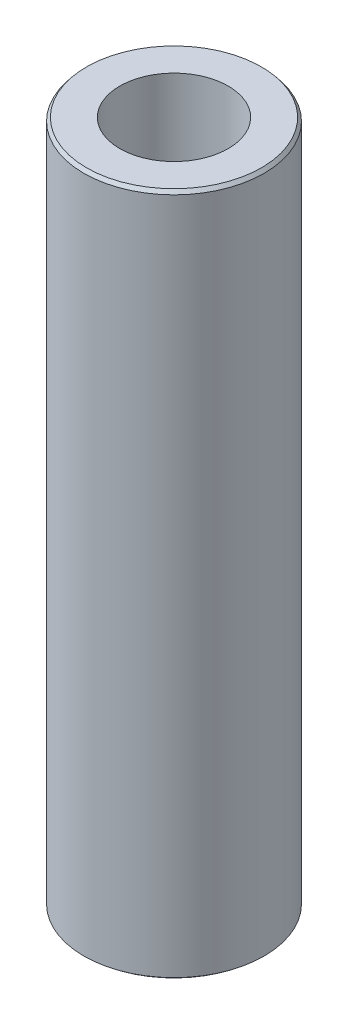
ISO-10303-21;
HEADER;
FILE_DESCRIPTION(('STEP AP214'),'2;1');
FILE_NAME('part.step','',(''),(''),'','','');
FILE_SCHEMA(('AUTOMOTIVE_DESIGN { 1 0 10303 214 1 1 1 1 }'));
ENDSEC;
DATA;
#1=APPLICATION_CONTEXT('core data for automotive mechanical design processes');
#2=APPLICATION_PROTOCOL_DEFINITION('international standard','automotive_design',2000,#1);
#3=PRODUCT_CONTEXT('',#1,'mechanical');
#4=PRODUCT('Part','Part','',(#3));
#5=PRODUCT_RELATED_PRODUCT_CATEGORY('part','',(#4));
#6=PRODUCT_DEFINITION_FORMATION('','',#4);
#7=PRODUCT_DEFINITION_CONTEXT('part definition',#1,'design');
#8=PRODUCT_DEFINITION('design','',#6,#7);
#9=PRODUCT_DEFINITION_SHAPE('','',#8);
#10=(LENGTH_UNIT() NAMED_UNIT(*) SI_UNIT(.MILLI.,.METRE.));
#11=(NAMED_UNIT(*) PLANE_ANGLE_UNIT() SI_UNIT($,.RADIAN.));
#12=(NAMED_UNIT(*) SI_UNIT($,.STERADIAN.) SOLID_ANGLE_UNIT());
#13=UNCERTAINTY_MEASURE_WITH_UNIT(LENGTH_MEASURE(1.E-05),#10,'distance_accuracy_value','');
#14=(GEOMETRIC_REPRESENTATION_CONTEXT(3) GLOBAL_UNCERTAINTY_ASSIGNED_CONTEXT((#13)) GLOBAL_UNIT_ASSIGNED_CONTEXT((#10,
#11,#12)) REPRESENTATION_CONTEXT('',''));
#15=CARTESIAN_POINT('',(0.,0.,0.));
#16=DIRECTION('',(0.,0.,1.));
#17=DIRECTION('',(1.,0.,0.));
#18=AXIS2_PLACEMENT_3D('',#15,#16,#17);
#19=CARTESIAN_POINT('',(0.,113.818768585816,0.));
#20=DIRECTION('',(0.,-1.,0.));
#21=DIRECTION('',(0.,0.,-1.));
#22=AXIS2_PLACEMENT_3D('',#19,#20,#21);
#23=CYLINDRICAL_SURFACE('',#22,15.);
#24=CARTESIAN_POINT('',(0.,113.250826087263,0.));
#25=DIRECTION('',(0.,1.,0.));
#26=DIRECTION('',(0.,0.,1.));
#27=AXIS2_PLACEMENT_3D('',#24,#25,#26);
#28=CIRCLE('',#27,15.);
#29=CARTESIAN_POINT('',(0.,113.250826087263,15.));
#30=VERTEX_POINT('',#29);
#31=EDGE_CURVE('E50',#30,#30,#28,.F.);
#32=ORIENTED_EDGE('',*,*,#31,.T.);
#33=EDGE_LOOP('',(#32));
#34=FACE_BOUND('',#33,.T.);
#35=CARTESIAN_POINT('',(0.,0.449791564454419,0.));
#36=DIRECTION('',(0.,1.,0.));
#37=DIRECTION('',(0.,0.,1.));
#38=AXIS2_PLACEMENT_3D('',#35,#36,#37);
#39=CIRCLE('',#38,15.);
#40=CARTESIAN_POINT('',(0.,0.449791564454419,15.));
#41=VERTEX_POINT('',#40);
#42=EDGE_CURVE('E51',#41,#41,#39,.T.);
#43=ORIENTED_EDGE('',*,*,#42,.T.);
#44=EDGE_LOOP('',(#43));
#45=FACE_BOUND('',#44,.T.);
#46=ADVANCED_FACE('F39',(#34,#45),#23,.T.);
#47=CARTESIAN_POINT('',(0.,113.818768585816,0.));
#48=DIRECTION('',(0.,1.,0.));
#49=DIRECTION('',(0.,0.,1.));
#50=AXIS2_PLACEMENT_3D('',#47,#48,#49);
#51=PLANE('',#50);
#52=CARTESIAN_POINT('',(0.,113.818768585816,0.));
#53=DIRECTION('',(0.,1.,0.));
#54=DIRECTION('',(0.,0.,1.));
#55=AXIS2_PLACEMENT_3D('',#52,#53,#54);
#56=CIRCLE('',#55,14.5502084355456);
#57=CARTESIAN_POINT('',(0.,113.818768585816,14.5502084355456));
#58=VERTEX_POINT('',#57);
#59=EDGE_CURVE('E54',#58,#58,#56,.T.);
#60=ORIENTED_EDGE('',*,*,#59,.T.);
#61=EDGE_LOOP('',(#60));
#62=FACE_BOUND('',#61,.T.);
#63=CARTESIAN_POINT('',(0.,113.818768585816,0.));
#64=DIRECTION('',(0.,1.,0.));
#65=DIRECTION('',(0.,0.,1.));
#66=AXIS2_PLACEMENT_3D('',#63,#64,#65);
#67=CIRCLE('',#66,9.02254316330759);
#68=CARTESIAN_POINT('',(0.,113.818768585816,9.02254316330759));
#69=VERTEX_POINT('',#68);
#70=EDGE_CURVE('E58',#69,#69,#67,.T.);
#71=ORIENTED_EDGE('',*,*,#70,.F.);
#72=EDGE_LOOP('',(#71));
#73=FACE_BOUND('',#72,.T.);
#74=ADVANCED_FACE('F69',(#62,#73),#51,.T.);
#75=CARTESIAN_POINT('',(0.,0.,0.));
#76=DIRECTION('',(0.,1.,0.));
#77=DIRECTION('',(0.,0.,1.));
#78=AXIS2_PLACEMENT_3D('',#75,#76,#77);
#79=PLANE('',#78);
#80=CARTESIAN_POINT('',(0.,0.,0.));
#81=DIRECTION('',(0.,1.,0.));
#82=DIRECTION('',(0.,0.,1.));
#83=AXIS2_PLACEMENT_3D('',#80,#81,#82);
#84=CIRCLE('',#83,14.4320575014473);
#85=CARTESIAN_POINT('',(0.,0.,14.4320575014473));
#86=VERTEX_POINT('',#85);
#87=EDGE_CURVE('E10',#86,#86,#84,.F.);
#88=ORIENTED_EDGE('',*,*,#87,.T.);
#89=EDGE_LOOP('',(#88));
#90=FACE_BOUND('',#89,.T.);
#91=CARTESIAN_POINT('',(0.,0.,0.));
#92=DIRECTION('',(0.,1.,0.));
#93=DIRECTION('',(0.,0.,1.));
#94=AXIS2_PLACEMENT_3D('',#91,#92,#93);
#95=CIRCLE('',#94,9.02254316330759);
#96=CARTESIAN_POINT('',(0.,0.,9.02254316330759));
#97=VERTEX_POINT('',#96);
#98=EDGE_CURVE('E63',#97,#97,#95,.T.);
#99=ORIENTED_EDGE('',*,*,#98,.T.);
#100=EDGE_LOOP('',(#99));
#101=FACE_BOUND('',#100,.T.);
#102=ADVANCED_FACE('F75',(#90,#101),#79,.F.);
#103=CARTESIAN_POINT('',(0.,113.818768585816,0.));
#104=DIRECTION('',(0.,-1.,0.));
#105=DIRECTION('',(0.,0.,-1.));
#106=AXIS2_PLACEMENT_3D('',#103,#104,#105);
#107=CYLINDRICAL_SURFACE('',#106,9.02254316330759);
#108=ORIENTED_EDGE('',*,*,#70,.T.);
#109=EDGE_LOOP('',(#108));
#110=FACE_BOUND('',#109,.T.);
#111=ORIENTED_EDGE('',*,*,#98,.F.);
#112=EDGE_LOOP('',(#111));
#113=FACE_BOUND('',#112,.T.);
#114=ADVANCED_FACE('F70',(#110,#113),#107,.F.);
#115=CARTESIAN_POINT('',(0.,113.818768585816,0.));
#116=DIRECTION('',(0.,-1.,0.));
#117=DIRECTION('',(0.,0.,-1.));
#118=AXIS2_PLACEMENT_3D('',#115,#116,#117);
#119=CONICAL_SURFACE('',#118,14.5502084355456,0.66982337716521);
#120=ORIENTED_EDGE('',*,*,#31,.F.);
#121=EDGE_LOOP('',(#120));
#122=FACE_BOUND('',#121,.T.);
#123=ORIENTED_EDGE('',*,*,#59,.F.);
#124=EDGE_LOOP('',(#123));
#125=FACE_BOUND('',#124,.T.);
#126=ADVANCED_FACE('F81',(#122,#125),#119,.T.);
#127=CARTESIAN_POINT('',(0.,0.449791564454419,0.));
#128=DIRECTION('',(0.,1.,0.));
#129=DIRECTION('',(0.,0.,1.));
#130=AXIS2_PLACEMENT_3D('',#127,#128,#129);
#131=CONICAL_SURFACE('',#130,15.,0.900972949629668);
#132=ORIENTED_EDGE('',*,*,#87,.F.);
#133=EDGE_LOOP('',(#132));
#134=FACE_BOUND('',#133,.T.);
#135=ORIENTED_EDGE('',*,*,#42,.F.);
#136=EDGE_LOOP('',(#135));
#137=FACE_BOUND('',#136,.T.);
#138=ADVANCED_FACE('F45',(#134,#137),#131,.T.);
#139=CLOSED_SHELL('',(#46,#74,#102,#114,#126,#138));
#140=MANIFOLD_SOLID_BREP('B2',#139);
#141=ADVANCED_BREP_SHAPE_REPRESENTATION('',(#18,#140),#14);
#142=SHAPE_DEFINITION_REPRESENTATION(#9,#141);
ENDSEC;
END-ISO-10303-21;
